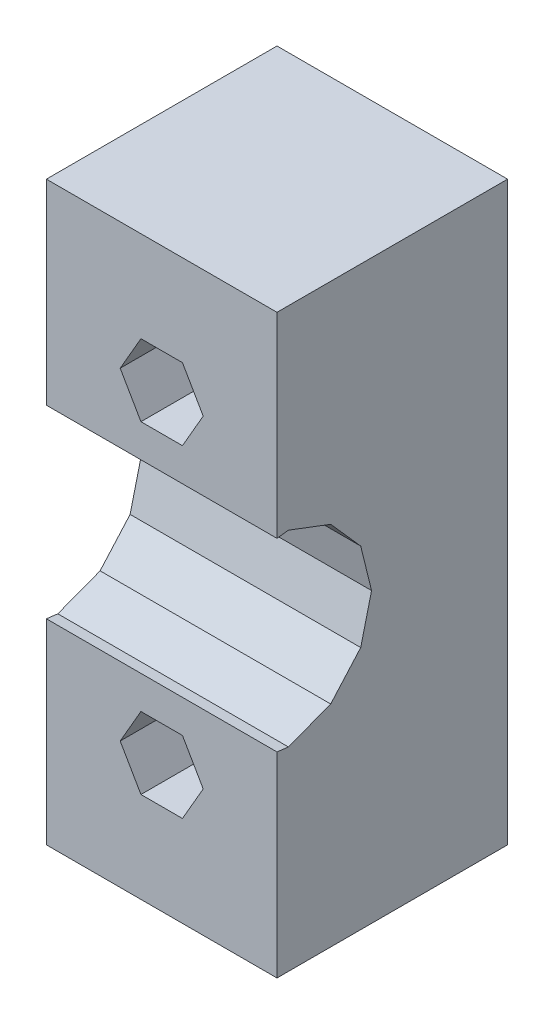
ISO-10303-21;
HEADER;
FILE_DESCRIPTION(('STEP AP214'),'2;1');
FILE_NAME('part.step','',(''),(''),'','','');
FILE_SCHEMA(('AUTOMOTIVE_DESIGN { 1 0 10303 214 1 1 1 1 }'));
ENDSEC;
DATA;
#1=APPLICATION_CONTEXT('core data for automotive mechanical design processes');
#2=APPLICATION_PROTOCOL_DEFINITION('international standard','automotive_design',2000,#1);
#3=PRODUCT_CONTEXT('',#1,'mechanical');
#4=PRODUCT('Part','Part','',(#3));
#5=PRODUCT_RELATED_PRODUCT_CATEGORY('part','',(#4));
#6=PRODUCT_DEFINITION_FORMATION('','',#4);
#7=PRODUCT_DEFINITION_CONTEXT('part definition',#1,'design');
#8=PRODUCT_DEFINITION('design','',#6,#7);
#9=PRODUCT_DEFINITION_SHAPE('','',#8);
#10=(LENGTH_UNIT() NAMED_UNIT(*) SI_UNIT(.MILLI.,.METRE.));
#11=(NAMED_UNIT(*) PLANE_ANGLE_UNIT() SI_UNIT($,.RADIAN.));
#12=(NAMED_UNIT(*) SI_UNIT($,.STERADIAN.) SOLID_ANGLE_UNIT());
#13=UNCERTAINTY_MEASURE_WITH_UNIT(LENGTH_MEASURE(1.E-05),#10,'distance_accuracy_value','');
#14=(GEOMETRIC_REPRESENTATION_CONTEXT(3) GLOBAL_UNCERTAINTY_ASSIGNED_CONTEXT((#13)) GLOBAL_UNIT_ASSIGNED_CONTEXT((#10,
#11,#12)) REPRESENTATION_CONTEXT('',''));
#15=CARTESIAN_POINT('',(0.,0.,0.));
#16=DIRECTION('',(0.,0.,1.));
#17=DIRECTION('',(1.,0.,0.));
#18=AXIS2_PLACEMENT_3D('',#15,#16,#17);
#19=CARTESIAN_POINT('',(-17.1672397202567,4.55455639727638,23.3131363859466));
#20=DIRECTION('',(0.,0.99270878246258,-0.120537434938949));
#21=DIRECTION('',(0.,0.120537434938949,0.99270878246258));
#22=AXIS2_PLACEMENT_3D('',#19,#20,#21);
#23=PLANE('',#22);
#24=DIRECTION('',(1.,0.,0.));
#25=VECTOR('',#24,1.);
#26=CARTESIAN_POINT('',(-17.7315157923947,4.53918143821454,23.1865130104016));
#27=LINE('',#26,#25);
#28=CARTESIAN_POINT('',(-22.2886010932875,4.53918143821416,23.1865130104016));
#29=VERTEX_POINT('',#28);
#30=CARTESIAN_POINT('',(-12.2886010932877,4.53918143821426,23.1865130104016));
#31=VERTEX_POINT('',#30);
#32=EDGE_CURVE('E274',#29,#31,#27,.T.);
#33=ORIENTED_EDGE('',*,*,#32,.F.);
#34=DIRECTION('',(0.,-0.120537434938949,-0.99270878246258));
#35=VECTOR('',#34,1.);
#36=CARTESIAN_POINT('',(-22.2886010932877,4.58381357448838,23.5540893876646));
#37=LINE('',#36,#35);
#38=CARTESIAN_POINT('',(-22.2886010932876,4.59918853355053,23.6807127632096));
#39=VERTEX_POINT('',#38);
#40=EDGE_CURVE('E41',#39,#29,#37,.T.);
#41=ORIENTED_EDGE('',*,*,#40,.F.);
#42=DIRECTION('',(-1.,0.,0.));
#43=VECTOR('',#42,1.);
#44=CARTESIAN_POINT('',(-12.2886010932877,4.59918853355038,23.6807127632096));
#45=LINE('',#44,#43);
#46=CARTESIAN_POINT('',(-12.2886010932876,4.5991885335505,23.6807127632096));
#47=VERTEX_POINT('',#46);
#48=EDGE_CURVE('E285',#39,#47,#45,.F.);
#49=ORIENTED_EDGE('',*,*,#48,.T.);
#50=DIRECTION('',(0.,-0.120537434937309,-0.992708782462779));
#51=VECTOR('',#50,1.);
#52=CARTESIAN_POINT('',(-12.2886010932877,4.59918853355038,23.6807127632096));
#53=LINE('',#52,#51);
#54=EDGE_CURVE('E265',#47,#31,#53,.T.);
#55=ORIENTED_EDGE('',*,*,#54,.T.);
#56=EDGE_LOOP('',(#33,#41,#49,#55));
#57=FACE_BOUND('',#56,.T.);
#58=ADVANCED_FACE('F38',(#57),#23,.T.);
#59=CARTESIAN_POINT('',(-16.3886011171297,14.0504414708674,23.6807127632096));
#60=DIRECTION('',(0.,-1.,0.));
#61=DIRECTION('',(0.,0.,-1.));
#62=AXIS2_PLACEMENT_3D('',#59,#60,#61);
#63=PLANE('',#62);
#64=DIRECTION('',(0.,0.,1.));
#65=VECTOR('',#64,1.);
#66=CARTESIAN_POINT('',(-18.1886010694457,14.0504414708674,23.6807127632096));
#67=LINE('',#66,#65);
#68=CARTESIAN_POINT('',(-18.1886010694497,14.0504414708743,13.6807127632096));
#69=VERTEX_POINT('',#68);
#70=CARTESIAN_POINT('',(-18.1886010694434,14.0504414708635,23.6807127632096));
#71=VERTEX_POINT('',#70);
#72=EDGE_CURVE('E312',#69,#71,#67,.T.);
#73=ORIENTED_EDGE('',*,*,#72,.T.);
#74=DIRECTION('',(-1.,0.,0.));
#75=VECTOR('',#74,1.);
#76=CARTESIAN_POINT('',(-18.1886010694457,14.0504414708674,23.6807127632096));
#77=LINE('',#76,#75);
#78=CARTESIAN_POINT('',(-16.3886011171297,14.0504414708674,23.6807127632096));
#79=VERTEX_POINT('',#78);
#80=EDGE_CURVE('E326',#71,#79,#77,.F.);
#81=ORIENTED_EDGE('',*,*,#80,.T.);
#82=DIRECTION('',(0.,0.,1.));
#83=VECTOR('',#82,1.);
#84=CARTESIAN_POINT('',(-16.3886011171296,14.0504414708674,23.6807127632096));
#85=LINE('',#84,#83);
#86=CARTESIAN_POINT('',(-16.3886011171296,14.0504414708674,13.6807127632096));
#87=VERTEX_POINT('',#86);
#88=EDGE_CURVE('E308',#79,#87,#85,.F.);
#89=ORIENTED_EDGE('',*,*,#88,.T.);
#90=DIRECTION('',(1.,0.,0.));
#91=VECTOR('',#90,1.);
#92=CARTESIAN_POINT('',(-16.3886011171297,14.0504414708674,13.6807127632096));
#93=LINE('',#92,#91);
#94=EDGE_CURVE('E288',#69,#87,#93,.T.);
#95=ORIENTED_EDGE('',*,*,#94,.F.);
#96=EDGE_LOOP('',(#73,#81,#89,#95));
#97=FACE_BOUND('',#96,.T.);
#98=ADVANCED_FACE('F586',(#97),#63,.F.);
#99=CARTESIAN_POINT('',(-16.1435125370607,0.474947081702381,19.0905357346396));
#100=DIRECTION('',(0.866025513253365,-0.49999981039421,0.));
#101=DIRECTION('',(0.49999981039421,0.866025513253365,0.));
#102=AXIS2_PLACEMENT_3D('',#99,#100,#101);
#103=PLANE('',#102);
#104=DIRECTION('',(0.,0.,-1.));
#105=VECTOR('',#104,1.);
#106=CARTESIAN_POINT('',(-16.3886011171297,0.0504409940303794,13.6807127632096));
#107=LINE('',#106,#105);
#108=CARTESIAN_POINT('',(-16.38860111713,0.050440994030565,13.6807127632096));
#109=VERTEX_POINT('',#108);
#110=CARTESIAN_POINT('',(-16.3886011171297,0.0504409940304072,23.6807127632096));
#111=VERTEX_POINT('',#110);
#112=EDGE_CURVE('E344',#109,#111,#107,.F.);
#113=ORIENTED_EDGE('',*,*,#112,.T.);
#114=DIRECTION('',(0.49999981039421,0.866025513253365,0.));
#115=VECTOR('',#114,1.);
#116=CARTESIAN_POINT('',(-16.1435125370607,0.474947081702381,23.6807127632096));
#117=LINE('',#116,#115);
#118=CARTESIAN_POINT('',(-15.4886011409716,1.60928746772437,23.6807127632096));
#119=VERTEX_POINT('',#118);
#120=EDGE_CURVE('E253',#119,#111,#117,.F.);
#121=ORIENTED_EDGE('',*,*,#120,.F.);
#122=DIRECTION('',(0.,0.,1.));
#123=VECTOR('',#122,1.);
#124=CARTESIAN_POINT('',(-15.4886011409717,1.60928746772437,23.6807127632096));
#125=LINE('',#124,#123);
#126=CARTESIAN_POINT('',(-15.4886011409717,1.60928746772439,13.6807127632096));
#127=VERTEX_POINT('',#126);
#128=EDGE_CURVE('E305',#119,#127,#125,.F.);
#129=ORIENTED_EDGE('',*,*,#128,.T.);
#130=DIRECTION('',(-0.499999810394001,-0.866025513253486,0.));
#131=VECTOR('',#130,1.);
#132=CARTESIAN_POINT('',(-15.4886011409717,1.60928746772438,13.6807127632096));
#133=LINE('',#132,#131);
#134=EDGE_CURVE('E340',#127,#109,#133,.T.);
#135=ORIENTED_EDGE('',*,*,#134,.T.);
#136=EDGE_LOOP('',(#113,#121,#129,#135));
#137=FACE_BOUND('',#136,.T.);
#138=ADVANCED_FACE('F777',(#137),#103,.F.);
#139=CARTESIAN_POINT('',(-15.7336897165047,15.1847815177614,18.2708898767286));
#140=DIRECTION('',(-0.866025447026178,0.499999925103103,0.));
#141=DIRECTION('',(-0.499999925103103,-0.866025447026178,0.));
#142=AXIS2_PLACEMENT_3D('',#139,#140,#141);
#143=PLANE('',#142);
#144=DIRECTION('',(-0.499999925103108,-0.866025447026175,0.));
#145=VECTOR('',#144,1.);
#146=CARTESIAN_POINT('',(-15.4886011409717,15.6092874677244,13.6807127632096));
#147=LINE('',#146,#145);
#148=CARTESIAN_POINT('',(-15.4886011409729,15.6092874677219,13.6807127632096));
#149=VERTEX_POINT('',#148);
#150=EDGE_CURVE('E351',#149,#87,#147,.T.);
#151=ORIENTED_EDGE('',*,*,#150,.T.);
#152=ORIENTED_EDGE('',*,*,#88,.F.);
#153=DIRECTION('',(0.499999925103108,0.866025447026175,0.));
#154=VECTOR('',#153,1.);
#155=CARTESIAN_POINT('',(-16.3886011171297,14.0504414708674,23.6807127632096));
#156=LINE('',#155,#154);
#157=CARTESIAN_POINT('',(-15.4886011409716,15.6092874677243,23.6807127632096));
#158=VERTEX_POINT('',#157);
#159=EDGE_CURVE('E355',#79,#158,#156,.T.);
#160=ORIENTED_EDGE('',*,*,#159,.T.);
#161=DIRECTION('',(0.,0.,1.));
#162=VECTOR('',#161,1.);
#163=CARTESIAN_POINT('',(-15.4886011409717,15.6092874677243,19.0905357346396));
#164=LINE('',#163,#162);
#165=EDGE_CURVE('E359',#158,#149,#164,.F.);
#166=ORIENTED_EDGE('',*,*,#165,.T.);
#167=EDGE_LOOP('',(#151,#152,#160,#166));
#168=FACE_BOUND('',#167,.T.);
#169=ADVANCED_FACE('F601',(#168),#143,.T.);
#170=CARTESIAN_POINT('',(-18.8435124700707,15.1847815177614,18.2708898767286));
#171=DIRECTION('',(0.866025447026178,0.499999925103103,0.));
#172=DIRECTION('',(-0.499999925103103,0.866025447026178,0.));
#173=AXIS2_PLACEMENT_3D('',#170,#171,#172);
#174=PLANE('',#173);
#175=DIRECTION('',(0.,0.,1.));
#176=VECTOR('',#175,1.);
#177=CARTESIAN_POINT('',(-19.0886010456036,15.6092874677243,19.0905357346396));
#178=LINE('',#177,#176);
#179=CARTESIAN_POINT('',(-19.088601045601,15.6092874677196,23.6807127632096));
#180=VERTEX_POINT('',#179);
#181=CARTESIAN_POINT('',(-19.0886010456231,15.6092874677577,13.6807127632096));
#182=VERTEX_POINT('',#181);
#183=EDGE_CURVE('E367',#180,#182,#178,.F.);
#184=ORIENTED_EDGE('',*,*,#183,.F.);
#185=DIRECTION('',(0.499999925103107,-0.866025447026175,0.));
#186=VECTOR('',#185,1.);
#187=CARTESIAN_POINT('',(-19.0886010456037,15.6092874677244,23.6807127632096));
#188=LINE('',#187,#186);
#189=EDGE_CURVE('E363',#180,#71,#188,.T.);
#190=ORIENTED_EDGE('',*,*,#189,.T.);
#191=ORIENTED_EDGE('',*,*,#72,.F.);
#192=DIRECTION('',(-0.499999925103103,0.866025447026178,0.));
#193=VECTOR('',#192,1.);
#194=CARTESIAN_POINT('',(-18.8435124700707,15.1847815177614,13.6807127632096));
#195=LINE('',#194,#193);
#196=EDGE_CURVE('E282',#69,#182,#195,.T.);
#197=ORIENTED_EDGE('',*,*,#196,.T.);
#198=EDGE_LOOP('',(#184,#190,#191,#197));
#199=FACE_BOUND('',#198,.T.);
#200=ADVANCED_FACE('F591',(#199),#174,.T.);
#201=CARTESIAN_POINT('',(-12.2886010932877,5.23505350661938,21.3516479171706));
#202=DIRECTION('',(0.,-0.935016322615487,-0.354604676284185));
#203=DIRECTION('',(0.,0.354604676284185,-0.935016322615487));
#204=AXIS2_PLACEMENT_3D('',#201,#202,#203);
#205=PLANE('',#204);
#206=DIRECTION('',(1.,0.,0.));
#207=VECTOR('',#206,1.);
#208=CARTESIAN_POINT('',(-17.7315159814547,5.23505350661916,21.3516479171703));
#209=LINE('',#208,#207);
#210=CARTESIAN_POINT('',(-22.2886010932877,5.23505350661919,21.3516479171705));
#211=VERTEX_POINT('',#210);
#212=CARTESIAN_POINT('',(-12.2886010932877,5.23505350661935,21.3516479171705));
#213=VERTEX_POINT('',#212);
#214=EDGE_CURVE('E380',#211,#213,#209,.T.);
#215=ORIENTED_EDGE('',*,*,#214,.F.);
#216=DIRECTION('',(0.,-0.354604676284445,0.935016322615389));
#217=VECTOR('',#216,1.);
#218=CARTESIAN_POINT('',(-22.2886010932877,5.23505350661938,21.3516479171706));
#219=LINE('',#218,#217);
#220=EDGE_CURVE('E279',#211,#29,#219,.T.);
#221=ORIENTED_EDGE('',*,*,#220,.T.);
#222=ORIENTED_EDGE('',*,*,#32,.T.);
#223=DIRECTION('',(0.,0.354604676284185,-0.935016322615487));
#224=VECTOR('',#223,1.);
#225=CARTESIAN_POINT('',(-12.2886010932877,5.23505350661938,21.3516479171706));
#226=LINE('',#225,#224);
#227=EDGE_CURVE('E259',#213,#31,#226,.F.);
#228=ORIENTED_EDGE('',*,*,#227,.F.);
#229=EDGE_LOOP('',(#215,#221,#222,#228));
#230=FACE_BOUND('',#229,.T.);
#231=ADVANCED_FACE('F278',(#230),#205,.F.);
#232=CARTESIAN_POINT('',(-16.3886011171297,0.0504409940303794,23.6807127632096));
#233=DIRECTION('',(0.,-1.,0.));
#234=DIRECTION('',(0.,0.,-1.));
#235=AXIS2_PLACEMENT_3D('',#232,#233,#234);
#236=PLANE('',#235);
#237=DIRECTION('',(0.,0.,1.));
#238=VECTOR('',#237,1.);
#239=CARTESIAN_POINT('',(-18.1886010694453,0.0504409940305772,19.0905357346396));
#240=LINE('',#239,#238);
#241=CARTESIAN_POINT('',(-18.1886010694456,0.050440994030395,13.6807127632096));
#242=VERTEX_POINT('',#241);
#243=CARTESIAN_POINT('',(-18.1886010694456,0.0504409940303846,23.6807127632096));
#244=VERTEX_POINT('',#243);
#245=EDGE_CURVE('E400',#242,#244,#240,.T.);
#246=ORIENTED_EDGE('',*,*,#245,.T.);
#247=DIRECTION('',(1.,0.,0.));
#248=VECTOR('',#247,1.);
#249=CARTESIAN_POINT('',(-16.3886011171297,0.0504409940303794,23.6807127632096));
#250=LINE('',#249,#248);
#251=EDGE_CURVE('E347',#111,#244,#250,.F.);
#252=ORIENTED_EDGE('',*,*,#251,.F.);
#253=ORIENTED_EDGE('',*,*,#112,.F.);
#254=DIRECTION('',(1.,0.,0.));
#255=VECTOR('',#254,1.);
#256=CARTESIAN_POINT('',(-18.1886010694457,0.0504409940303794,13.6807127632096));
#257=LINE('',#256,#255);
#258=EDGE_CURVE('E392',#109,#242,#257,.F.);
#259=ORIENTED_EDGE('',*,*,#258,.T.);
#260=EDGE_LOOP('',(#246,#252,#253,#259));
#261=FACE_BOUND('',#260,.T.);
#262=ADVANCED_FACE('F625',(#261),#236,.F.);
#263=CARTESIAN_POINT('',(-19.0886010456037,1.60928746772438,23.6807127632096));
#264=DIRECTION('',(0.,0.,-1.));
#265=DIRECTION('',(-1.,0.,0.));
#266=AXIS2_PLACEMENT_3D('',#263,#264,#265);
#267=PLANE('',#266);
#268=DIRECTION('',(0.,1.,0.));
#269=VECTOR('',#268,1.);
#270=CARTESIAN_POINT('',(-12.2886010932877,4.59918853355038,23.6807127632096));
#271=LINE('',#270,#269);
#272=CARTESIAN_POINT('',(-12.2886010932877,-3.89071253227562,23.6807127632096));
#273=VERTEX_POINT('',#272);
#274=EDGE_CURVE('E338',#273,#47,#271,.T.);
#275=ORIENTED_EDGE('',*,*,#274,.T.);
#276=ORIENTED_EDGE('',*,*,#48,.F.);
#277=DIRECTION('',(0.,1.,0.));
#278=VECTOR('',#277,1.);
#279=CARTESIAN_POINT('',(-22.2886010932877,4.59918853355038,23.6807127632096));
#280=LINE('',#279,#278);
#281=CARTESIAN_POINT('',(-22.2886010932877,-3.89071253227562,23.6807127632096));
#282=VERTEX_POINT('',#281);
#283=EDGE_CURVE('E293',#282,#39,#280,.T.);
#284=ORIENTED_EDGE('',*,*,#283,.F.);
#285=DIRECTION('',(1.,0.,0.));
#286=VECTOR('',#285,1.);
#287=CARTESIAN_POINT('',(-12.2886010932877,-3.89071253227562,23.6807127632096));
#288=LINE('',#287,#286);
#289=EDGE_CURVE('E334',#282,#273,#288,.T.);
#290=ORIENTED_EDGE('',*,*,#289,.T.);
#291=EDGE_LOOP('',(#275,#276,#284,#290));
#292=FACE_BOUND('',#291,.T.);
#293=DIRECTION('',(-0.499999925103103,-0.866025447026178,0.));
#294=VECTOR('',#293,1.);
#295=CARTESIAN_POINT('',(-18.8435124700707,2.03379341768738,23.6807127632096));
#296=LINE('',#295,#294);
#297=CARTESIAN_POINT('',(-19.0886010456037,1.60928746772441,23.6807127632096));
#298=VERTEX_POINT('',#297);
#299=CARTESIAN_POINT('',(-18.1886010694456,3.16813346458138,23.6807127632096));
#300=VERTEX_POINT('',#299);
#301=EDGE_CURVE('E407',#298,#300,#296,.F.);
#302=ORIENTED_EDGE('',*,*,#301,.T.);
#303=DIRECTION('',(1.,0.,0.));
#304=VECTOR('',#303,1.);
#305=CARTESIAN_POINT('',(-18.1886010694457,3.16813346458138,23.6807127632096));
#306=LINE('',#305,#304);
#307=CARTESIAN_POINT('',(-16.3886011171297,3.16813346458138,23.6807127632096));
#308=VERTEX_POINT('',#307);
#309=EDGE_CURVE('E404',#300,#308,#306,.T.);
#310=ORIENTED_EDGE('',*,*,#309,.T.);
#311=DIRECTION('',(-0.499999925103103,0.866025447026178,0.));
#312=VECTOR('',#311,1.);
#313=CARTESIAN_POINT('',(-16.3886011171297,3.16813346458138,23.6807127632096));
#314=LINE('',#313,#312);
#315=EDGE_CURVE('E302',#308,#119,#314,.F.);
#316=ORIENTED_EDGE('',*,*,#315,.T.);
#317=ORIENTED_EDGE('',*,*,#120,.T.);
#318=ORIENTED_EDGE('',*,*,#251,.T.);
#319=DIRECTION('',(0.49999981039421,-0.866025513253365,0.));
#320=VECTOR('',#319,1.);
#321=CARTESIAN_POINT('',(-18.4336896495147,0.474947081702381,23.6807127632096));
#322=LINE('',#321,#320);
#323=EDGE_CURVE('E396',#244,#298,#322,.F.);
#324=ORIENTED_EDGE('',*,*,#323,.T.);
#325=EDGE_LOOP('',(#302,#310,#316,#317,#318,#324));
#326=FACE_BOUND('',#325,.T.);
#327=ADVANCED_FACE('F553',(#292,#326),#267,.F.);
#328=CARTESIAN_POINT('',(-16.1435125415967,2.74362751461838,18.2708898767286));
#329=DIRECTION('',(0.866025447026178,0.499999925103103,0.));
#330=DIRECTION('',(-0.499999925103103,0.866025447026178,0.));
#331=AXIS2_PLACEMENT_3D('',#328,#329,#330);
#332=PLANE('',#331);
#333=DIRECTION('',(0.499999925103108,-0.866025447026175,0.));
#334=VECTOR('',#333,1.);
#335=CARTESIAN_POINT('',(-16.3886011171297,3.16813346458138,13.6807127632096));
#336=LINE('',#335,#334);
#337=CARTESIAN_POINT('',(-16.3886011171298,3.1681334645813,13.6807127632096));
#338=VERTEX_POINT('',#337);
#339=EDGE_CURVE('E415',#338,#127,#336,.T.);
#340=ORIENTED_EDGE('',*,*,#339,.T.);
#341=ORIENTED_EDGE('',*,*,#128,.F.);
#342=ORIENTED_EDGE('',*,*,#315,.F.);
#343=DIRECTION('',(0.,0.,1.));
#344=VECTOR('',#343,1.);
#345=CARTESIAN_POINT('',(-16.3886011171297,3.16813346458138,13.6807127632096));
#346=LINE('',#345,#344);
#347=EDGE_CURVE('E411',#308,#338,#346,.F.);
#348=ORIENTED_EDGE('',*,*,#347,.T.);
#349=EDGE_LOOP('',(#340,#341,#342,#348));
#350=FACE_BOUND('',#349,.T.);
#351=ADVANCED_FACE('F624',(#350),#332,.F.);
#352=CARTESIAN_POINT('',(-15.7336897210407,16.0337935553954,19.0905357346396));
#353=DIRECTION('',(0.866025513253365,0.49999981039421,0.));
#354=DIRECTION('',(-0.49999981039421,0.866025513253365,0.));
#355=AXIS2_PLACEMENT_3D('',#352,#353,#354);
#356=PLANE('',#355);
#357=ORIENTED_EDGE('',*,*,#165,.F.);
#358=DIRECTION('',(-0.499999810394001,0.866025513253486,0.));
#359=VECTOR('',#358,1.);
#360=CARTESIAN_POINT('',(-15.4886011409717,15.6092874677244,23.6807127632096));
#361=LINE('',#360,#359);
#362=CARTESIAN_POINT('',(-16.3886011171299,17.1681339414182,23.6807127632096));
#363=VERTEX_POINT('',#362);
#364=EDGE_CURVE('E431',#158,#363,#361,.T.);
#365=ORIENTED_EDGE('',*,*,#364,.T.);
#366=DIRECTION('',(0.,0.,1.));
#367=VECTOR('',#366,1.);
#368=CARTESIAN_POINT('',(-16.3886011171297,17.1681339414184,13.6807127632096));
#369=LINE('',#368,#367);
#370=CARTESIAN_POINT('',(-16.3886011171298,17.1681339414183,13.6807127632096));
#371=VERTEX_POINT('',#370);
#372=EDGE_CURVE('E371',#363,#371,#369,.F.);
#373=ORIENTED_EDGE('',*,*,#372,.T.);
#374=DIRECTION('',(0.499999810394001,-0.866025513253486,0.));
#375=VECTOR('',#374,1.);
#376=CARTESIAN_POINT('',(-16.3886011171297,17.1681339414184,13.6807127632096));
#377=LINE('',#376,#375);
#378=EDGE_CURVE('E419',#371,#149,#377,.T.);
#379=ORIENTED_EDGE('',*,*,#378,.T.);
#380=EDGE_LOOP('',(#357,#365,#373,#379));
#381=FACE_BOUND('',#380,.T.);
#382=ADVANCED_FACE('F600',(#381),#356,.F.);
#383=CARTESIAN_POINT('',(-18.4336896495147,16.7436278537464,18.2708897917796));
#384=DIRECTION('',(0.866025513253365,-0.49999981039421,0.));
#385=DIRECTION('',(0.49999981039421,0.866025513253365,0.));
#386=AXIS2_PLACEMENT_3D('',#383,#384,#385);
#387=PLANE('',#386);
#388=DIRECTION('',(0.,0.,1.));
#389=VECTOR('',#388,1.);
#390=CARTESIAN_POINT('',(-18.1886010694457,17.1681339414184,23.6807127632096));
#391=LINE('',#390,#389);
#392=CARTESIAN_POINT('',(-18.1886010694456,17.1681339414184,13.6807127632096));
#393=VERTEX_POINT('',#392);
#394=CARTESIAN_POINT('',(-18.1886010694453,17.1681339414182,23.6807127632096));
#395=VERTEX_POINT('',#394);
#396=EDGE_CURVE('E439',#393,#395,#391,.T.);
#397=ORIENTED_EDGE('',*,*,#396,.T.);
#398=DIRECTION('',(-0.499999810394001,-0.866025513253486,0.));
#399=VECTOR('',#398,1.);
#400=CARTESIAN_POINT('',(-18.1886010694457,17.1681339414184,23.6807127632096));
#401=LINE('',#400,#399);
#402=EDGE_CURVE('E435',#395,#180,#401,.T.);
#403=ORIENTED_EDGE('',*,*,#402,.T.);
#404=ORIENTED_EDGE('',*,*,#183,.T.);
#405=DIRECTION('',(0.49999981039421,0.866025513253365,0.));
#406=VECTOR('',#405,1.);
#407=CARTESIAN_POINT('',(-18.4336896495147,16.7436278537464,13.6807127632096));
#408=LINE('',#407,#406);
#409=EDGE_CURVE('E375',#182,#393,#408,.T.);
#410=ORIENTED_EDGE('',*,*,#409,.T.);
#411=EDGE_LOOP('',(#397,#403,#404,#410));
#412=FACE_BOUND('',#411,.T.);
#413=ADVANCED_FACE('F594',(#412),#387,.T.);
#414=CARTESIAN_POINT('',(-12.2886010932877,5.23505350661938,21.3516479171706));
#415=DIRECTION('',(0.,-0.663122926257748,-0.748510510728715));
#416=DIRECTION('',(0.,0.748510510728715,-0.663122926257748));
#417=AXIS2_PLACEMENT_3D('',#414,#415,#416);
#418=PLANE('',#417);
#419=DIRECTION('',(1.,0.,0.));
#420=VECTOR('',#419,1.);
#421=CARTESIAN_POINT('',(-17.7315157932087,6.70392247749036,20.0503426231335));
#422=LINE('',#421,#420);
#423=CARTESIAN_POINT('',(-12.2886010932877,6.7039224774904,20.0503426231336));
#424=VERTEX_POINT('',#423);
#425=CARTESIAN_POINT('',(-22.2886010932877,6.70392247749048,20.0503426231337));
#426=VERTEX_POINT('',#425);
#427=EDGE_CURVE('E447',#424,#426,#422,.F.);
#428=ORIENTED_EDGE('',*,*,#427,.T.);
#429=DIRECTION('',(0.,-0.748510510728569,0.663122926257912));
#430=VECTOR('',#429,1.);
#431=CARTESIAN_POINT('',(-22.2886010932877,6.70392247749038,20.0503426231336));
#432=LINE('',#431,#430);
#433=EDGE_CURVE('E443',#426,#211,#432,.T.);
#434=ORIENTED_EDGE('',*,*,#433,.T.);
#435=ORIENTED_EDGE('',*,*,#214,.T.);
#436=DIRECTION('',(0.,0.748510510728715,-0.663122926257748));
#437=VECTOR('',#436,1.);
#438=CARTESIAN_POINT('',(-12.2886010932877,5.23505350661938,21.3516479171706));
#439=LINE('',#438,#437);
#440=EDGE_CURVE('E268',#424,#213,#439,.F.);
#441=ORIENTED_EDGE('',*,*,#440,.F.);
#442=EDGE_LOOP('',(#428,#434,#435,#441));
#443=FACE_BOUND('',#442,.T.);
#444=ADVANCED_FACE('F557',(#443),#418,.F.);
#445=CARTESIAN_POINT('',(-17.1672397202567,12.6640185381724,23.3131363859466));
#446=DIRECTION('',(0.,-0.99270878246258,-0.120537434938949));
#447=DIRECTION('',(0.,0.120537434938949,-0.99270878246258));
#448=AXIS2_PLACEMENT_3D('',#445,#446,#447);
#449=PLANE('',#448);
#450=DIRECTION('',(0.,-0.120537434937309,0.992708782462779));
#451=VECTOR('',#450,1.);
#452=CARTESIAN_POINT('',(-12.2886010932877,12.6793934972344,23.1865130104016));
#453=LINE('',#452,#451);
#454=CARTESIAN_POINT('',(-12.2886010932877,12.6793934972344,23.1865130104016));
#455=VERTEX_POINT('',#454);
#456=CARTESIAN_POINT('',(-12.2886010932878,12.6193864018982,23.6807127632095));
#457=VERTEX_POINT('',#456);
#458=EDGE_CURVE('E427',#455,#457,#453,.T.);
#459=ORIENTED_EDGE('',*,*,#458,.T.);
#460=DIRECTION('',(1.,0.,0.));
#461=VECTOR('',#460,1.);
#462=CARTESIAN_POINT('',(-17.4099624663187,12.6193864018977,23.6807127632095));
#463=LINE('',#462,#461);
#464=CARTESIAN_POINT('',(-22.2886010932877,12.6193864018981,23.6807127632095));
#465=VERTEX_POINT('',#464);
#466=EDGE_CURVE('E320',#465,#457,#463,.T.);
#467=ORIENTED_EDGE('',*,*,#466,.F.);
#468=DIRECTION('',(0.,-0.120537434938949,0.99270878246258));
#469=VECTOR('',#468,1.);
#470=CARTESIAN_POINT('',(-22.2886010932877,12.6347613609604,23.5540893876646));
#471=LINE('',#470,#469);
#472=CARTESIAN_POINT('',(-22.2886010932877,12.6793934972346,23.1865130104016));
#473=VERTEX_POINT('',#472);
#474=EDGE_CURVE('E323',#473,#465,#471,.T.);
#475=ORIENTED_EDGE('',*,*,#474,.F.);
#476=DIRECTION('',(1.,0.,0.));
#477=VECTOR('',#476,1.);
#478=CARTESIAN_POINT('',(-17.7315157923947,12.6793934972342,23.1865130104016));
#479=LINE('',#478,#477);
#480=EDGE_CURVE('E466',#473,#455,#479,.T.);
#481=ORIENTED_EDGE('',*,*,#480,.T.);
#482=EDGE_LOOP('',(#459,#467,#475,#481));
#483=FACE_BOUND('',#482,.T.);
#484=ADVANCED_FACE('F575',(#483),#449,.T.);
#485=CARTESIAN_POINT('',(-12.2886010932877,-3.89071253227562,13.6807127632096));
#486=DIRECTION('',(0.,1.,0.));
#487=DIRECTION('',(0.,0.,1.));
#488=AXIS2_PLACEMENT_3D('',#485,#486,#487);
#489=PLANE('',#488);
#490=DIRECTION('',(0.,0.,1.));
#491=VECTOR('',#490,1.);
#492=CARTESIAN_POINT('',(-12.2886010932877,-3.89071253227562,13.6807127632096));
#493=LINE('',#492,#491);
#494=CARTESIAN_POINT('',(-12.2886010932877,-3.89071253227511,13.6807127632099));
#495=VERTEX_POINT('',#494);
#496=EDGE_CURVE('E388',#273,#495,#493,.F.);
#497=ORIENTED_EDGE('',*,*,#496,.F.);
#498=ORIENTED_EDGE('',*,*,#289,.F.);
#499=DIRECTION('',(0.,0.,1.));
#500=VECTOR('',#499,1.);
#501=CARTESIAN_POINT('',(-22.2886010932877,-3.89071253227562,23.6807127632096));
#502=LINE('',#501,#500);
#503=CARTESIAN_POINT('',(-22.2886010932877,-3.89071253227563,13.6807127632096));
#504=VERTEX_POINT('',#503);
#505=EDGE_CURVE('E330',#504,#282,#502,.T.);
#506=ORIENTED_EDGE('',*,*,#505,.F.);
#507=DIRECTION('',(1.,0.,0.));
#508=VECTOR('',#507,1.);
#509=CARTESIAN_POINT('',(-22.2886010932877,-3.89071253227562,13.6807127632096));
#510=LINE('',#509,#508);
#511=EDGE_CURVE('E472',#504,#495,#510,.T.);
#512=ORIENTED_EDGE('',*,*,#511,.T.);
#513=EDGE_LOOP('',(#497,#498,#506,#512));
#514=FACE_BOUND('',#513,.T.);
#515=ADVANCED_FACE('F551',(#514),#489,.F.);
#516=CARTESIAN_POINT('',(-18.1886010694457,3.16813346458138,13.6807127632096));
#517=DIRECTION('',(0.,1.,0.));
#518=DIRECTION('',(0.,0.,1.));
#519=AXIS2_PLACEMENT_3D('',#516,#517,#518);
#520=PLANE('',#519);
#521=ORIENTED_EDGE('',*,*,#347,.F.);
#522=ORIENTED_EDGE('',*,*,#309,.F.);
#523=DIRECTION('',(0.,0.,1.));
#524=VECTOR('',#523,1.);
#525=CARTESIAN_POINT('',(-18.1886010694454,3.16813346458121,18.2708898767286));
#526=LINE('',#525,#524);
#527=CARTESIAN_POINT('',(-18.1886010694456,3.16813346458136,13.6807127632096));
#528=VERTEX_POINT('',#527);
#529=EDGE_CURVE('E480',#528,#300,#526,.T.);
#530=ORIENTED_EDGE('',*,*,#529,.F.);
#531=DIRECTION('',(1.,0.,0.));
#532=VECTOR('',#531,1.);
#533=CARTESIAN_POINT('',(-18.1886010694457,3.16813346458138,13.6807127632096));
#534=LINE('',#533,#532);
#535=EDGE_CURVE('E484',#528,#338,#534,.T.);
#536=ORIENTED_EDGE('',*,*,#535,.T.);
#537=EDGE_LOOP('',(#521,#522,#530,#536));
#538=FACE_BOUND('',#537,.T.);
#539=ADVANCED_FACE('F704',(#538),#520,.F.);
#540=CARTESIAN_POINT('',(-18.1886010694457,17.1681339414184,23.6807127632096));
#541=DIRECTION('',(0.,1.,0.));
#542=DIRECTION('',(0.,0.,1.));
#543=AXIS2_PLACEMENT_3D('',#540,#541,#542);
#544=PLANE('',#543);
#545=ORIENTED_EDGE('',*,*,#396,.F.);
#546=DIRECTION('',(1.,0.,0.));
#547=VECTOR('',#546,1.);
#548=CARTESIAN_POINT('',(-18.1886010694457,17.1681339414184,13.6807127632096));
#549=LINE('',#548,#547);
#550=EDGE_CURVE('E423',#393,#371,#549,.T.);
#551=ORIENTED_EDGE('',*,*,#550,.T.);
#552=ORIENTED_EDGE('',*,*,#372,.F.);
#553=DIRECTION('',(-1.,0.,0.));
#554=VECTOR('',#553,1.);
#555=CARTESIAN_POINT('',(-18.1886010694457,17.1681339414184,23.6807127632096));
#556=LINE('',#555,#554);
#557=EDGE_CURVE('E491',#363,#395,#556,.T.);
#558=ORIENTED_EDGE('',*,*,#557,.T.);
#559=EDGE_LOOP('',(#545,#551,#552,#558));
#560=FACE_BOUND('',#559,.T.);
#561=ADVANCED_FACE('F598',(#560),#544,.F.);
#562=CARTESIAN_POINT('',(-17.7315157932087,7.22656054128738,19.9215240544566));
#563=DIRECTION('',(0.,-0.239315411342116,-0.970941879771469));
#564=DIRECTION('',(0.,0.970941879771469,-0.239315411342116));
#565=AXIS2_PLACEMENT_3D('',#562,#563,#564);
#566=PLANE('',#565);
#567=ORIENTED_EDGE('',*,*,#427,.F.);
#568=DIRECTION('',(0.,-0.970941879771469,0.239315411342116));
#569=VECTOR('',#568,1.);
#570=CARTESIAN_POINT('',(-12.2886010932877,8.08664940392738,19.7095314272546));
#571=LINE('',#570,#569);
#572=CARTESIAN_POINT('',(-12.2886010932877,8.60928746772437,19.5807128585768));
#573=VERTEX_POINT('',#572);
#574=EDGE_CURVE('E385',#424,#573,#571,.F.);
#575=ORIENTED_EDGE('',*,*,#574,.T.);
#576=DIRECTION('',(1.,0.,0.));
#577=VECTOR('',#576,1.);
#578=CARTESIAN_POINT('',(-16.8456863933667,8.60928746772413,19.5807128585776));
#579=LINE('',#578,#577);
#580=CARTESIAN_POINT('',(-22.2886010932877,8.60928746772452,19.5807128585774));
#581=VERTEX_POINT('',#580);
#582=EDGE_CURVE('E455',#573,#581,#579,.F.);
#583=ORIENTED_EDGE('',*,*,#582,.T.);
#584=DIRECTION('',(0.,-0.970941879771361,0.239315411342556));
#585=VECTOR('',#584,1.);
#586=CARTESIAN_POINT('',(-22.2886010932877,8.60928746772438,19.5807128585766));
#587=LINE('',#586,#585);
#588=EDGE_CURVE('E495',#581,#426,#587,.T.);
#589=ORIENTED_EDGE('',*,*,#588,.T.);
#590=EDGE_LOOP('',(#567,#575,#583,#589));
#591=FACE_BOUND('',#590,.T.);
#592=ADVANCED_FACE('F560',(#591),#566,.F.);
#593=CARTESIAN_POINT('',(-17.7315157923947,12.4885170865304,22.6832129369776));
#594=DIRECTION('',(0.,0.935016322615487,-0.354604676284185));
#595=DIRECTION('',(0.,0.354604676284185,0.935016322615487));
#596=AXIS2_PLACEMENT_3D('',#593,#594,#595);
#597=PLANE('',#596);
#598=DIRECTION('',(0.,-0.354604676284445,-0.935016322615388));
#599=VECTOR('',#598,1.);
#600=CARTESIAN_POINT('',(-22.2886010932877,12.6793934972344,23.1865130104016));
#601=LINE('',#600,#599);
#602=CARTESIAN_POINT('',(-22.2886010932876,11.9835214288296,21.3516479171705));
#603=VERTEX_POINT('',#602);
#604=EDGE_CURVE('E506',#473,#603,#601,.T.);
#605=ORIENTED_EDGE('',*,*,#604,.T.);
#606=DIRECTION('',(1.,0.,0.));
#607=VECTOR('',#606,1.);
#608=CARTESIAN_POINT('',(-17.7315159814547,11.9835214288296,21.3516479171703));
#609=LINE('',#608,#607);
#610=CARTESIAN_POINT('',(-12.2886010932877,11.9835214288294,21.3516479171705));
#611=VERTEX_POINT('',#610);
#612=EDGE_CURVE('E502',#603,#611,#609,.T.);
#613=ORIENTED_EDGE('',*,*,#612,.T.);
#614=DIRECTION('',(0.,-0.354604676284185,-0.935016322615487));
#615=VECTOR('',#614,1.);
#616=CARTESIAN_POINT('',(-12.2886010932877,12.1743978395334,21.8549479905946));
#617=LINE('',#616,#615);
#618=EDGE_CURVE('E459',#611,#455,#617,.F.);
#619=ORIENTED_EDGE('',*,*,#618,.T.);
#620=ORIENTED_EDGE('',*,*,#480,.F.);
#621=EDGE_LOOP('',(#605,#613,#619,#620));
#622=FACE_BOUND('',#621,.T.);
#623=ADVANCED_FACE('F572',(#622),#597,.F.);
#624=CARTESIAN_POINT('',(-18.8435124655347,1.18478138005338,18.2708897917796));
#625=DIRECTION('',(0.866025513253365,0.49999981039421,0.));
#626=DIRECTION('',(-0.49999981039421,0.866025513253365,0.));
#627=AXIS2_PLACEMENT_3D('',#624,#625,#626);
#628=PLANE('',#627);
#629=DIRECTION('',(0.,0.,1.));
#630=VECTOR('',#629,1.);
#631=CARTESIAN_POINT('',(-19.0886010456036,1.60928746772443,18.2708897917796));
#632=LINE('',#631,#630);
#633=CARTESIAN_POINT('',(-19.0886010456037,1.60928746772446,13.6807127632096));
#634=VERTEX_POINT('',#633);
#635=EDGE_CURVE('E476',#634,#298,#632,.T.);
#636=ORIENTED_EDGE('',*,*,#635,.T.);
#637=ORIENTED_EDGE('',*,*,#323,.F.);
#638=ORIENTED_EDGE('',*,*,#245,.F.);
#639=DIRECTION('',(-0.499999810394001,0.866025513253486,0.));
#640=VECTOR('',#639,1.);
#641=CARTESIAN_POINT('',(-18.1886010694457,0.0504409940303794,13.6807127632096));
#642=LINE('',#641,#640);
#643=EDGE_CURVE('E510',#242,#634,#642,.T.);
#644=ORIENTED_EDGE('',*,*,#643,.T.);
#645=EDGE_LOOP('',(#636,#637,#638,#644));
#646=FACE_BOUND('',#645,.T.);
#647=ADVANCED_FACE('F636',(#646),#628,.T.);
#648=CARTESIAN_POINT('',(-18.4336896449787,2.74362751461838,18.2708898767286));
#649=DIRECTION('',(0.866025447026178,-0.499999925103103,0.));
#650=DIRECTION('',(0.499999925103103,0.866025447026178,0.));
#651=AXIS2_PLACEMENT_3D('',#648,#649,#650);
#652=PLANE('',#651);
#653=ORIENTED_EDGE('',*,*,#529,.T.);
#654=ORIENTED_EDGE('',*,*,#301,.F.);
#655=ORIENTED_EDGE('',*,*,#635,.F.);
#656=DIRECTION('',(0.499999925103108,0.866025447026175,0.));
#657=VECTOR('',#656,1.);
#658=CARTESIAN_POINT('',(-19.0886010456037,1.60928746772438,13.6807127632096));
#659=LINE('',#658,#657);
#660=EDGE_CURVE('E514',#634,#528,#659,.T.);
#661=ORIENTED_EDGE('',*,*,#660,.T.);
#662=EDGE_LOOP('',(#653,#654,#655,#661));
#663=FACE_BOUND('',#662,.T.);
#664=ADVANCED_FACE('F650',(#663),#652,.T.);
#665=CARTESIAN_POINT('',(-12.2886010932877,21.1092874677244,23.6807127632096));
#666=DIRECTION('',(-1.,0.,0.));
#667=DIRECTION('',(0.,0.,1.));
#668=AXIS2_PLACEMENT_3D('',#665,#666,#667);
#669=PLANE('',#668);
#670=DIRECTION('',(0.,1.,0.));
#671=VECTOR('',#670,1.);
#672=CARTESIAN_POINT('',(-12.2886010932877,21.1092874677244,23.6807127632096));
#673=LINE('',#672,#671);
#674=CARTESIAN_POINT('',(-12.2886010932877,21.1092874677244,23.6807127632096));
#675=VERTEX_POINT('',#674);
#676=EDGE_CURVE('E488',#675,#457,#673,.F.);
#677=ORIENTED_EDGE('',*,*,#676,.T.);
#678=ORIENTED_EDGE('',*,*,#458,.F.);
#679=ORIENTED_EDGE('',*,*,#618,.F.);
#680=DIRECTION('',(0.,-0.748510510728715,-0.663122926257748));
#681=VECTOR('',#680,1.);
#682=CARTESIAN_POINT('',(-12.2886010932877,10.9175604942434,20.4072882534276));
#683=LINE('',#682,#681);
#684=CARTESIAN_POINT('',(-12.2886010932877,10.5146524579584,20.0503426231336));
#685=VERTEX_POINT('',#684);
#686=EDGE_CURVE('E463',#685,#611,#683,.F.);
#687=ORIENTED_EDGE('',*,*,#686,.F.);
#688=DIRECTION('',(0.,0.970941879771469,0.239315411342116));
#689=VECTOR('',#688,1.);
#690=CARTESIAN_POINT('',(-12.2886010932877,9.13192553152138,19.7095314272546));
#691=LINE('',#690,#689);
#692=EDGE_CURVE('E451',#685,#573,#691,.F.);
#693=ORIENTED_EDGE('',*,*,#692,.T.);
#694=ORIENTED_EDGE('',*,*,#574,.F.);
#695=ORIENTED_EDGE('',*,*,#440,.T.);
#696=ORIENTED_EDGE('',*,*,#227,.T.);
#697=ORIENTED_EDGE('',*,*,#54,.F.);
#698=ORIENTED_EDGE('',*,*,#274,.F.);
#699=ORIENTED_EDGE('',*,*,#496,.T.);
#700=DIRECTION('',(0.,1.,0.));
#701=VECTOR('',#700,1.);
#702=CARTESIAN_POINT('',(-12.2886010932877,21.1092874677244,13.6807127632096));
#703=LINE('',#702,#701);
#704=CARTESIAN_POINT('',(-12.2886010932181,21.1092874678439,13.6807127632097));
#705=VERTEX_POINT('',#704);
#706=EDGE_CURVE('E273',#705,#495,#703,.F.);
#707=ORIENTED_EDGE('',*,*,#706,.F.);
#708=DIRECTION('',(0.,0.,-1.));
#709=VECTOR('',#708,1.);
#710=CARTESIAN_POINT('',(-12.2886010932877,21.1092874677244,13.6807127632096));
#711=LINE('',#710,#709);
#712=EDGE_CURVE('E522',#705,#675,#711,.F.);
#713=ORIENTED_EDGE('',*,*,#712,.T.);
#714=EDGE_LOOP('',(#677,#678,#679,#687,#693,#694,#695,#696,#697,#698,#699,#707,#713));
#715=FACE_BOUND('',#714,.T.);
#716=ADVANCED_FACE('F262',(#715),#669,.F.);
#717=CARTESIAN_POINT('',(-17.7315157932087,9.99201439416138,19.9215240544566));
#718=DIRECTION('',(0.,-0.239315411342116,0.970941879771469));
#719=DIRECTION('',(0.,-0.970941879771469,-0.239315411342116));
#720=AXIS2_PLACEMENT_3D('',#717,#718,#719);
#721=PLANE('',#720);
#722=DIRECTION('',(0.,-0.970941879771361,-0.239315411342556));
#723=VECTOR('',#722,1.);
#724=CARTESIAN_POINT('',(-22.2886010932877,10.5146524579584,20.0503426231336));
#725=LINE('',#724,#723);
#726=CARTESIAN_POINT('',(-22.2886010932877,10.5146524579585,20.0503426231334));
#727=VERTEX_POINT('',#726);
#728=EDGE_CURVE('E526',#727,#581,#725,.T.);
#729=ORIENTED_EDGE('',*,*,#728,.T.);
#730=ORIENTED_EDGE('',*,*,#582,.F.);
#731=ORIENTED_EDGE('',*,*,#692,.F.);
#732=DIRECTION('',(1.,0.,0.));
#733=VECTOR('',#732,1.);
#734=CARTESIAN_POINT('',(-17.7315157932087,10.5146524579584,20.0503426231335));
#735=LINE('',#734,#733);
#736=EDGE_CURVE('E499',#685,#727,#735,.F.);
#737=ORIENTED_EDGE('',*,*,#736,.T.);
#738=EDGE_LOOP('',(#729,#730,#731,#737));
#739=FACE_BOUND('',#738,.T.);
#740=ADVANCED_FACE('F666',(#739),#721,.T.);
#741=CARTESIAN_POINT('',(-17.7315159814547,11.5806133925454,20.9947022868766));
#742=DIRECTION('',(0.,0.663122926257748,-0.748510510728715));
#743=DIRECTION('',(0.,0.748510510728715,0.663122926257748));
#744=AXIS2_PLACEMENT_3D('',#741,#742,#743);
#745=PLANE('',#744);
#746=DIRECTION('',(0.,-0.748510510728569,-0.663122926257912));
#747=VECTOR('',#746,1.);
#748=CARTESIAN_POINT('',(-22.2886010932877,11.9835214288294,21.3516479171706));
#749=LINE('',#748,#747);
#750=EDGE_CURVE('E530',#603,#727,#749,.T.);
#751=ORIENTED_EDGE('',*,*,#750,.T.);
#752=ORIENTED_EDGE('',*,*,#736,.F.);
#753=ORIENTED_EDGE('',*,*,#686,.T.);
#754=ORIENTED_EDGE('',*,*,#612,.F.);
#755=EDGE_LOOP('',(#751,#752,#753,#754));
#756=FACE_BOUND('',#755,.T.);
#757=ADVANCED_FACE('F568',(#756),#745,.F.);
#758=CARTESIAN_POINT('',(-12.2886010932877,21.1092874677244,23.6807127632096));
#759=DIRECTION('',(0.,0.,-1.));
#760=DIRECTION('',(-1.,0.,0.));
#761=AXIS2_PLACEMENT_3D('',#758,#759,#760);
#762=PLANE('',#761);
#763=DIRECTION('',(0.,1.,0.));
#764=VECTOR('',#763,1.);
#765=CARTESIAN_POINT('',(-22.2886010932877,12.6793934972344,23.6807127632096));
#766=LINE('',#765,#764);
#767=CARTESIAN_POINT('',(-22.2886010924862,21.1092874663456,23.6807127632096));
#768=VERTEX_POINT('',#767);
#769=EDGE_CURVE('E60',#768,#465,#766,.F.);
#770=ORIENTED_EDGE('',*,*,#769,.T.);
#771=ORIENTED_EDGE('',*,*,#466,.T.);
#772=ORIENTED_EDGE('',*,*,#676,.F.);
#773=DIRECTION('',(1.,0.,0.));
#774=VECTOR('',#773,1.);
#775=CARTESIAN_POINT('',(-22.2886010932877,21.1092874677244,23.6807127632096));
#776=LINE('',#775,#774);
#777=EDGE_CURVE('E534',#675,#768,#776,.F.);
#778=ORIENTED_EDGE('',*,*,#777,.T.);
#779=EDGE_LOOP('',(#770,#771,#772,#778));
#780=FACE_BOUND('',#779,.T.);
#781=ORIENTED_EDGE('',*,*,#159,.F.);
#782=ORIENTED_EDGE('',*,*,#80,.F.);
#783=ORIENTED_EDGE('',*,*,#189,.F.);
#784=ORIENTED_EDGE('',*,*,#402,.F.);
#785=ORIENTED_EDGE('',*,*,#557,.F.);
#786=ORIENTED_EDGE('',*,*,#364,.F.);
#787=EDGE_LOOP('',(#781,#782,#783,#784,#785,#786));
#788=FACE_BOUND('',#787,.T.);
#789=ADVANCED_FACE('F577',(#780,#788),#762,.F.);
#790=CARTESIAN_POINT('',(-22.2886010932877,-3.89071253227562,13.6807127632096));
#791=DIRECTION('',(0.,0.,1.));
#792=DIRECTION('',(1.,0.,0.));
#793=AXIS2_PLACEMENT_3D('',#790,#791,#792);
#794=PLANE('',#793);
#795=ORIENTED_EDGE('',*,*,#196,.F.);
#796=ORIENTED_EDGE('',*,*,#94,.T.);
#797=ORIENTED_EDGE('',*,*,#150,.F.);
#798=ORIENTED_EDGE('',*,*,#378,.F.);
#799=ORIENTED_EDGE('',*,*,#550,.F.);
#800=ORIENTED_EDGE('',*,*,#409,.F.);
#801=EDGE_LOOP('',(#795,#796,#797,#798,#799,#800));
#802=FACE_BOUND('',#801,.T.);
#803=ORIENTED_EDGE('',*,*,#706,.T.);
#804=ORIENTED_EDGE('',*,*,#511,.F.);
#805=DIRECTION('',(0.,1.,0.));
#806=VECTOR('',#805,1.);
#807=CARTESIAN_POINT('',(-22.2886010932877,-3.89071253227562,13.6807127632096));
#808=LINE('',#807,#806);
#809=CARTESIAN_POINT('',(-22.288601093423,21.1092874679573,13.6807127632096));
#810=VERTEX_POINT('',#809);
#811=EDGE_CURVE('E48',#504,#810,#808,.T.);
#812=ORIENTED_EDGE('',*,*,#811,.T.);
#813=DIRECTION('',(1.,0.,0.));
#814=VECTOR('',#813,1.);
#815=CARTESIAN_POINT('',(-22.2886010932877,21.1092874677244,13.6807127632096));
#816=LINE('',#815,#814);
#817=EDGE_CURVE('E518',#810,#705,#816,.T.);
#818=ORIENTED_EDGE('',*,*,#817,.T.);
#819=EDGE_LOOP('',(#803,#804,#812,#818));
#820=FACE_BOUND('',#819,.T.);
#821=ORIENTED_EDGE('',*,*,#134,.F.);
#822=ORIENTED_EDGE('',*,*,#339,.F.);
#823=ORIENTED_EDGE('',*,*,#535,.F.);
#824=ORIENTED_EDGE('',*,*,#660,.F.);
#825=ORIENTED_EDGE('',*,*,#643,.F.);
#826=ORIENTED_EDGE('',*,*,#258,.F.);
#827=EDGE_LOOP('',(#821,#822,#823,#824,#825,#826));
#828=FACE_BOUND('',#827,.T.);
#829=ADVANCED_FACE('F542',(#802,#820,#828),#794,.F.);
#830=CARTESIAN_POINT('',(-22.2886010932877,21.1092874677244,23.6807127632096));
#831=DIRECTION('',(0.,-1.,0.));
#832=DIRECTION('',(0.,0.,-1.));
#833=AXIS2_PLACEMENT_3D('',#830,#831,#832);
#834=PLANE('',#833);
#835=ORIENTED_EDGE('',*,*,#777,.F.);
#836=ORIENTED_EDGE('',*,*,#712,.F.);
#837=ORIENTED_EDGE('',*,*,#817,.F.);
#838=DIRECTION('',(0.,0.,-1.));
#839=VECTOR('',#838,1.);
#840=CARTESIAN_POINT('',(-22.2886010932877,21.1092874677244,13.6807127632096));
#841=LINE('',#840,#839);
#842=EDGE_CURVE('E11',#810,#768,#841,.F.);
#843=ORIENTED_EDGE('',*,*,#842,.T.);
#844=EDGE_LOOP('',(#835,#836,#837,#843));
#845=FACE_BOUND('',#844,.T.);
#846=ADVANCED_FACE('F549',(#845),#834,.F.);
#847=CARTESIAN_POINT('',(-22.2886010932877,-3.89071253227562,13.6807127632096));
#848=DIRECTION('',(1.,0.,0.));
#849=DIRECTION('',(0.,0.,-1.));
#850=AXIS2_PLACEMENT_3D('',#847,#848,#849);
#851=PLANE('',#850);
#852=ORIENTED_EDGE('',*,*,#842,.F.);
#853=ORIENTED_EDGE('',*,*,#811,.F.);
#854=ORIENTED_EDGE('',*,*,#505,.T.);
#855=ORIENTED_EDGE('',*,*,#283,.T.);
#856=ORIENTED_EDGE('',*,*,#40,.T.);
#857=ORIENTED_EDGE('',*,*,#220,.F.);
#858=ORIENTED_EDGE('',*,*,#433,.F.);
#859=ORIENTED_EDGE('',*,*,#588,.F.);
#860=ORIENTED_EDGE('',*,*,#728,.F.);
#861=ORIENTED_EDGE('',*,*,#750,.F.);
#862=ORIENTED_EDGE('',*,*,#604,.F.);
#863=ORIENTED_EDGE('',*,*,#474,.T.);
#864=ORIENTED_EDGE('',*,*,#769,.F.);
#865=EDGE_LOOP('',(#852,#853,#854,#855,#856,#857,#858,#859,#860,#861,#862,#863,#864));
#866=FACE_BOUND('',#865,.T.);
#867=ADVANCED_FACE('F545',(#866),#851,.F.);
#868=CLOSED_SHELL('',(#58,#98,#138,#169,#200,#231,#262,#327,#351,#382,#413,#444,#484,#515,#539,
#561,#592,#623,#647,#664,#716,#740,#757,#789,#829,#846,#867));
#869=MANIFOLD_SOLID_BREP('B2',#868);
#870=ADVANCED_BREP_SHAPE_REPRESENTATION('',(#18,#869),#14);
#871=SHAPE_DEFINITION_REPRESENTATION(#9,#870);
ENDSEC;
END-ISO-10303-21;
